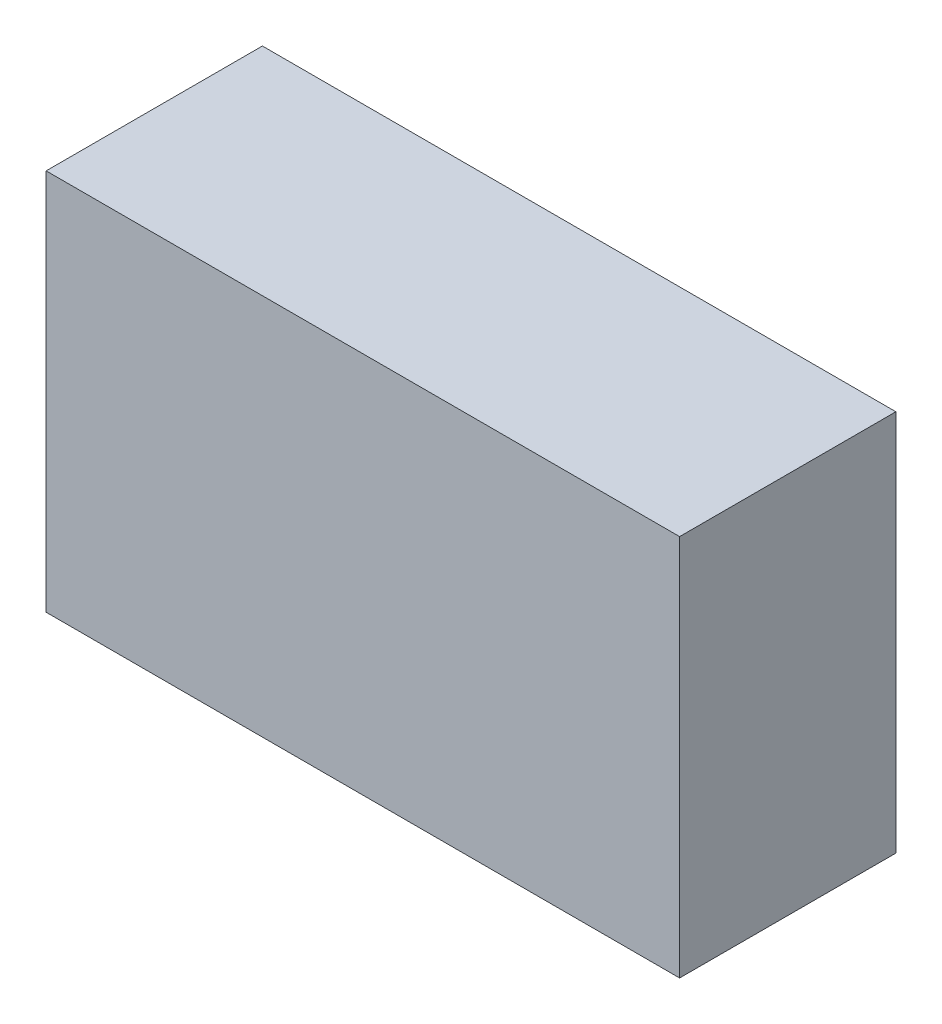
ISO-10303-21;
HEADER;
FILE_DESCRIPTION(('STEP AP214'),'2;1');
FILE_NAME('part.step','',(''),(''),'','','');
FILE_SCHEMA(('AUTOMOTIVE_DESIGN { 1 0 10303 214 1 1 1 1 }'));
ENDSEC;
DATA;
#1=APPLICATION_CONTEXT('core data for automotive mechanical design processes');
#2=APPLICATION_PROTOCOL_DEFINITION('international standard','automotive_design',2000,#1);
#3=PRODUCT_CONTEXT('',#1,'mechanical');
#4=PRODUCT('Part','Part','',(#3));
#5=PRODUCT_RELATED_PRODUCT_CATEGORY('part','',(#4));
#6=PRODUCT_DEFINITION_FORMATION('','',#4);
#7=PRODUCT_DEFINITION_CONTEXT('part definition',#1,'design');
#8=PRODUCT_DEFINITION('design','',#6,#7);
#9=PRODUCT_DEFINITION_SHAPE('','',#8);
#10=(LENGTH_UNIT() NAMED_UNIT(*) SI_UNIT(.MILLI.,.METRE.));
#11=(NAMED_UNIT(*) PLANE_ANGLE_UNIT() SI_UNIT($,.RADIAN.));
#12=(NAMED_UNIT(*) SI_UNIT($,.STERADIAN.) SOLID_ANGLE_UNIT());
#13=UNCERTAINTY_MEASURE_WITH_UNIT(LENGTH_MEASURE(1.E-05),#10,'distance_accuracy_value','');
#14=(GEOMETRIC_REPRESENTATION_CONTEXT(3) GLOBAL_UNCERTAINTY_ASSIGNED_CONTEXT((#13)) GLOBAL_UNIT_ASSIGNED_CONTEXT((#10,
#11,#12)) REPRESENTATION_CONTEXT('',''));
#15=CARTESIAN_POINT('',(0.,0.,0.));
#16=DIRECTION('',(0.,0.,1.));
#17=DIRECTION('',(1.,0.,0.));
#18=AXIS2_PLACEMENT_3D('',#15,#16,#17);
#19=CARTESIAN_POINT('',(-1.4499971,0.87500206,0.99000056));
#20=DIRECTION('',(0.,0.,1.));
#21=DIRECTION('',(1.,0.,0.));
#22=AXIS2_PLACEMENT_3D('',#19,#20,#21);
#23=PLANE('',#22);
#24=DIRECTION('',(0.,1.,0.));
#25=VECTOR('',#24,1.);
#26=CARTESIAN_POINT('',(1.44999964,0.87499952,0.99000056));
#27=LINE('',#26,#25);
#28=CARTESIAN_POINT('',(1.44999964,0.874999520000001,0.99000056));
#29=VERTEX_POINT('',#28);
#30=CARTESIAN_POINT('',(1.44999964,-0.87500079,0.99000056));
#31=VERTEX_POINT('',#30);
#32=EDGE_CURVE('E52',#29,#31,#27,.F.);
#33=ORIENTED_EDGE('',*,*,#32,.F.);
#34=DIRECTION('',(-0.999999999999616,8.75863052520164E-07,0.));
#35=VECTOR('',#34,1.);
#36=CARTESIAN_POINT('',(-1.4499971,0.87500206,0.99000056));
#37=LINE('',#36,#35);
#38=CARTESIAN_POINT('',(-1.4499971,0.875001425,0.99000056));
#39=VERTEX_POINT('',#38);
#40=EDGE_CURVE('E67',#39,#29,#37,.F.);
#41=ORIENTED_EDGE('',*,*,#40,.F.);
#42=DIRECTION('',(0.,1.,0.));
#43=VECTOR('',#42,1.);
#44=CARTESIAN_POINT('',(-1.4499971,-0.87499952,0.99000056));
#45=LINE('',#44,#43);
#46=CARTESIAN_POINT('',(-1.4499971,-0.874999520000001,0.99000056));
#47=VERTEX_POINT('',#46);
#48=EDGE_CURVE('E19',#47,#39,#45,.T.);
#49=ORIENTED_EDGE('',*,*,#48,.F.);
#50=DIRECTION('',(0.999999999999616,-8.75863052520164E-07,0.));
#51=VECTOR('',#50,1.);
#52=CARTESIAN_POINT('',(1.44999964,-0.87500206,0.99000056));
#53=LINE('',#52,#51);
#54=EDGE_CURVE('E57',#31,#47,#53,.F.);
#55=ORIENTED_EDGE('',*,*,#54,.F.);
#56=EDGE_LOOP('',(#33,#41,#49,#55));
#57=FACE_BOUND('',#56,.T.);
#58=ADVANCED_FACE('F16',(#57),#23,.T.);
#59=CARTESIAN_POINT('',(-1.4499971,-0.87499952,0.));
#60=DIRECTION('',(-1.,0.,0.));
#61=DIRECTION('',(0.,0.,1.));
#62=AXIS2_PLACEMENT_3D('',#59,#60,#61);
#63=PLANE('',#62);
#64=DIRECTION('',(0.,0.,1.));
#65=VECTOR('',#64,1.);
#66=CARTESIAN_POINT('',(-1.4499971,0.87500206,0.));
#67=LINE('',#66,#65);
#68=CARTESIAN_POINT('',(-1.4499971,0.875001425,0.));
#69=VERTEX_POINT('',#68);
#70=EDGE_CURVE('E78',#69,#39,#67,.T.);
#71=ORIENTED_EDGE('',*,*,#70,.F.);
#72=DIRECTION('',(0.,1.,0.));
#73=VECTOR('',#72,1.);
#74=CARTESIAN_POINT('',(-1.4499971,0.87500206,0.));
#75=LINE('',#74,#73);
#76=CARTESIAN_POINT('',(-1.4499971,-0.874999520000001,0.));
#77=VERTEX_POINT('',#76);
#78=EDGE_CURVE('E73',#69,#77,#75,.F.);
#79=ORIENTED_EDGE('',*,*,#78,.T.);
#80=DIRECTION('',(0.,0.,1.));
#81=VECTOR('',#80,1.);
#82=CARTESIAN_POINT('',(-1.4499971,-0.874999520000003,0.));
#83=LINE('',#82,#81);
#84=EDGE_CURVE('E62',#47,#77,#83,.F.);
#85=ORIENTED_EDGE('',*,*,#84,.F.);
#86=ORIENTED_EDGE('',*,*,#48,.T.);
#87=EDGE_LOOP('',(#71,#79,#85,#86));
#88=FACE_BOUND('',#87,.T.);
#89=ADVANCED_FACE('F72',(#88),#63,.T.);
#90=CARTESIAN_POINT('',(1.44999964,-0.87500206,0.));
#91=DIRECTION('',(-8.75863052520164E-07,-0.999999999999616,0.));
#92=DIRECTION('',(0.999999999999616,-8.75863052520164E-07,0.));
#93=AXIS2_PLACEMENT_3D('',#90,#91,#92);
#94=PLANE('',#93);
#95=ORIENTED_EDGE('',*,*,#84,.T.);
#96=DIRECTION('',(1.,0.,0.));
#97=VECTOR('',#96,1.);
#98=CARTESIAN_POINT('',(-1.4499971,-0.87499952,0.));
#99=LINE('',#98,#97);
#100=CARTESIAN_POINT('',(1.44999964,-0.875001425,0.));
#101=VERTEX_POINT('',#100);
#102=EDGE_CURVE('E83',#77,#101,#99,.T.);
#103=ORIENTED_EDGE('',*,*,#102,.T.);
#104=DIRECTION('',(0.,0.,-1.));
#105=VECTOR('',#104,1.);
#106=CARTESIAN_POINT('',(1.44999964,-0.87500206,0.));
#107=LINE('',#106,#105);
#108=EDGE_CURVE('E64',#31,#101,#107,.T.);
#109=ORIENTED_EDGE('',*,*,#108,.F.);
#110=ORIENTED_EDGE('',*,*,#54,.T.);
#111=EDGE_LOOP('',(#95,#103,#109,#110));
#112=FACE_BOUND('',#111,.T.);
#113=ADVANCED_FACE('F59',(#112),#94,.T.);
#114=CARTESIAN_POINT('',(1.44999964,0.87499952,0.));
#115=DIRECTION('',(1.,0.,0.));
#116=DIRECTION('',(0.,0.,-1.));
#117=AXIS2_PLACEMENT_3D('',#114,#115,#116);
#118=PLANE('',#117);
#119=ORIENTED_EDGE('',*,*,#108,.T.);
#120=DIRECTION('',(0.,1.,0.));
#121=VECTOR('',#120,1.);
#122=CARTESIAN_POINT('',(1.44999964,0.87500206,0.));
#123=LINE('',#122,#121);
#124=CARTESIAN_POINT('',(1.44999964,0.874999520000001,0.));
#125=VERTEX_POINT('',#124);
#126=EDGE_CURVE('E25',#101,#125,#123,.T.);
#127=ORIENTED_EDGE('',*,*,#126,.T.);
#128=DIRECTION('',(0.,0.,1.));
#129=VECTOR('',#128,1.);
#130=CARTESIAN_POINT('',(1.44999964,0.874999520000003,0.));
#131=LINE('',#130,#129);
#132=EDGE_CURVE('E33',#29,#125,#131,.F.);
#133=ORIENTED_EDGE('',*,*,#132,.F.);
#134=ORIENTED_EDGE('',*,*,#32,.T.);
#135=EDGE_LOOP('',(#119,#127,#133,#134));
#136=FACE_BOUND('',#135,.T.);
#137=ADVANCED_FACE('F87',(#136),#118,.T.);
#138=CARTESIAN_POINT('',(-1.4499971,0.87500206,0.));
#139=DIRECTION('',(8.75863052520164E-07,0.999999999999616,0.));
#140=DIRECTION('',(-0.999999999999616,8.75863052520164E-07,0.));
#141=AXIS2_PLACEMENT_3D('',#138,#139,#140);
#142=PLANE('',#141);
#143=ORIENTED_EDGE('',*,*,#132,.T.);
#144=DIRECTION('',(1.,0.,0.));
#145=VECTOR('',#144,1.);
#146=CARTESIAN_POINT('',(-1.4499971,0.87499952,0.));
#147=LINE('',#146,#145);
#148=EDGE_CURVE('E11',#125,#69,#147,.F.);
#149=ORIENTED_EDGE('',*,*,#148,.T.);
#150=ORIENTED_EDGE('',*,*,#70,.T.);
#151=ORIENTED_EDGE('',*,*,#40,.T.);
#152=EDGE_LOOP('',(#143,#149,#150,#151));
#153=FACE_BOUND('',#152,.T.);
#154=ADVANCED_FACE('F90',(#153),#142,.T.);
#155=CARTESIAN_POINT('',(-1.4499971,0.87500206,0.));
#156=DIRECTION('',(0.,0.,1.));
#157=DIRECTION('',(1.,0.,0.));
#158=AXIS2_PLACEMENT_3D('',#155,#156,#157);
#159=PLANE('',#158);
#160=ORIENTED_EDGE('',*,*,#126,.F.);
#161=ORIENTED_EDGE('',*,*,#102,.F.);
#162=ORIENTED_EDGE('',*,*,#78,.F.);
#163=ORIENTED_EDGE('',*,*,#148,.F.);
#164=EDGE_LOOP('',(#160,#161,#162,#163));
#165=FACE_BOUND('',#164,.T.);
#166=ADVANCED_FACE('F89',(#165),#159,.F.);
#167=CLOSED_SHELL('',(#58,#89,#113,#137,#154,#166));
#168=MANIFOLD_SOLID_BREP('B1',#167);
#169=ADVANCED_BREP_SHAPE_REPRESENTATION('',(#18,#168),#14);
#170=SHAPE_DEFINITION_REPRESENTATION(#9,#169);
ENDSEC;
END-ISO-10303-21;
